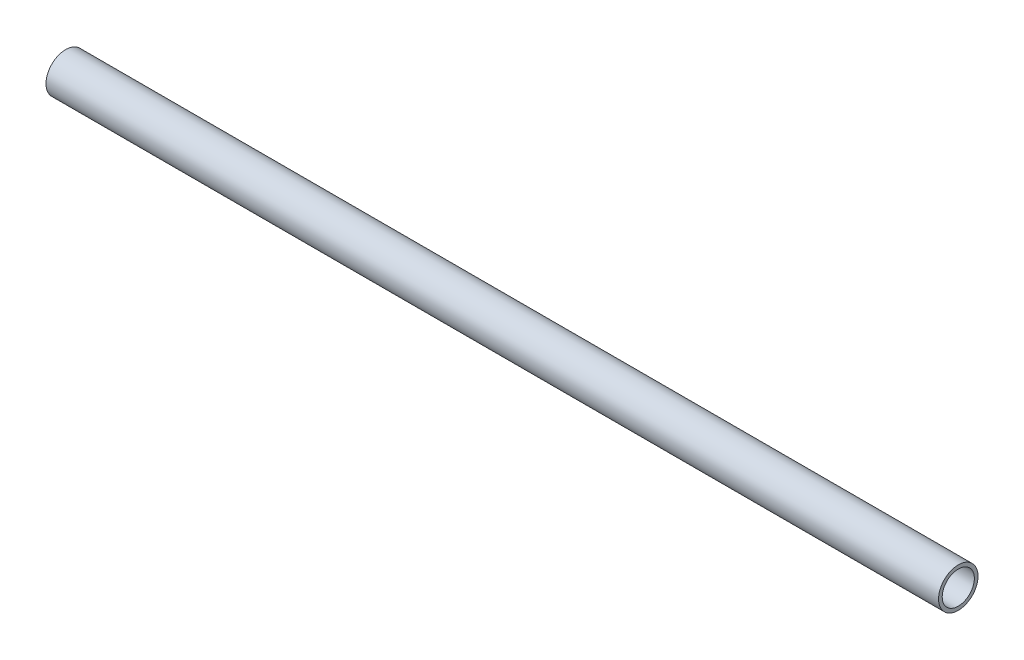
ISO-10303-21;
HEADER;
FILE_DESCRIPTION(('STEP AP214'),'2;1');
FILE_NAME('part.step','',(''),(''),'','','');
FILE_SCHEMA(('AUTOMOTIVE_DESIGN { 1 0 10303 214 1 1 1 1 }'));
ENDSEC;
DATA;
#1=APPLICATION_CONTEXT('core data for automotive mechanical design processes');
#2=APPLICATION_PROTOCOL_DEFINITION('international standard','automotive_design',2000,#1);
#3=PRODUCT_CONTEXT('',#1,'mechanical');
#4=PRODUCT('Part','Part','',(#3));
#5=PRODUCT_RELATED_PRODUCT_CATEGORY('part','',(#4));
#6=PRODUCT_DEFINITION_FORMATION('','',#4);
#7=PRODUCT_DEFINITION_CONTEXT('part definition',#1,'design');
#8=PRODUCT_DEFINITION('design','',#6,#7);
#9=PRODUCT_DEFINITION_SHAPE('','',#8);
#10=(LENGTH_UNIT() NAMED_UNIT(*) SI_UNIT(.MILLI.,.METRE.));
#11=(NAMED_UNIT(*) PLANE_ANGLE_UNIT() SI_UNIT($,.RADIAN.));
#12=(NAMED_UNIT(*) SI_UNIT($,.STERADIAN.) SOLID_ANGLE_UNIT());
#13=UNCERTAINTY_MEASURE_WITH_UNIT(LENGTH_MEASURE(1.E-05),#10,'distance_accuracy_value','');
#14=(GEOMETRIC_REPRESENTATION_CONTEXT(3) GLOBAL_UNCERTAINTY_ASSIGNED_CONTEXT((#13)) GLOBAL_UNIT_ASSIGNED_CONTEXT((#10,
#11,#12)) REPRESENTATION_CONTEXT('',''));
#15=CARTESIAN_POINT('',(0.,0.,0.));
#16=DIRECTION('',(0.,0.,1.));
#17=DIRECTION('',(1.,0.,0.));
#18=AXIS2_PLACEMENT_3D('',#15,#16,#17);
#19=CARTESIAN_POINT('',(358.775,0.,0.));
#20=DIRECTION('',(-1.,0.,0.));
#21=DIRECTION('',(0.,0.,-1.));
#22=AXIS2_PLACEMENT_3D('',#19,#20,#21);
#23=CYLINDRICAL_SURFACE('',#22,6.4643);
#24=CARTESIAN_POINT('',(358.775,0.,0.));
#25=DIRECTION('',(-1.,0.,0.));
#26=DIRECTION('',(0.,0.,1.));
#27=AXIS2_PLACEMENT_3D('',#24,#25,#26);
#28=CIRCLE('',#27,6.4643);
#29=CARTESIAN_POINT('',(358.775,0.,6.4643));
#30=VERTEX_POINT('',#29);
#31=EDGE_CURVE('E37',#30,#30,#28,.T.);
#32=ORIENTED_EDGE('',*,*,#31,.F.);
#33=EDGE_LOOP('',(#32));
#34=FACE_BOUND('',#33,.T.);
#35=CARTESIAN_POINT('',(0.,0.,0.));
#36=DIRECTION('',(-1.,0.,0.));
#37=DIRECTION('',(0.,0.,1.));
#38=AXIS2_PLACEMENT_3D('',#35,#36,#37);
#39=CIRCLE('',#38,6.4643);
#40=CARTESIAN_POINT('',(0.,0.,6.4643));
#41=VERTEX_POINT('',#40);
#42=EDGE_CURVE('E43',#41,#41,#39,.T.);
#43=ORIENTED_EDGE('',*,*,#42,.T.);
#44=EDGE_LOOP('',(#43));
#45=FACE_BOUND('',#44,.T.);
#46=ADVANCED_FACE('F30',(#34,#45),#23,.F.);
#47=CARTESIAN_POINT('',(358.775,0.,0.));
#48=DIRECTION('',(-1.,0.,0.));
#49=DIRECTION('',(0.,0.,-1.));
#50=AXIS2_PLACEMENT_3D('',#47,#48,#49);
#51=CYLINDRICAL_SURFACE('',#50,7.9375);
#52=CARTESIAN_POINT('',(358.775,0.,0.));
#53=DIRECTION('',(-1.,0.,0.));
#54=DIRECTION('',(0.,0.,1.));
#55=AXIS2_PLACEMENT_3D('',#52,#53,#54);
#56=CIRCLE('',#55,7.9375);
#57=CARTESIAN_POINT('',(358.775,0.,7.9375));
#58=VERTEX_POINT('',#57);
#59=EDGE_CURVE('E10',#58,#58,#56,.T.);
#60=ORIENTED_EDGE('',*,*,#59,.T.);
#61=EDGE_LOOP('',(#60));
#62=FACE_BOUND('',#61,.T.);
#63=CARTESIAN_POINT('',(0.,0.,0.));
#64=DIRECTION('',(-1.,0.,0.));
#65=DIRECTION('',(0.,0.,1.));
#66=AXIS2_PLACEMENT_3D('',#63,#64,#65);
#67=CIRCLE('',#66,7.9375);
#68=CARTESIAN_POINT('',(0.,0.,7.9375));
#69=VERTEX_POINT('',#68);
#70=EDGE_CURVE('E33',#69,#69,#67,.T.);
#71=ORIENTED_EDGE('',*,*,#70,.F.);
#72=EDGE_LOOP('',(#71));
#73=FACE_BOUND('',#72,.T.);
#74=ADVANCED_FACE('F52',(#62,#73),#51,.T.);
#75=CARTESIAN_POINT('',(358.775,0.,0.));
#76=DIRECTION('',(1.,0.,0.));
#77=DIRECTION('',(0.,0.,1.));
#78=AXIS2_PLACEMENT_3D('',#75,#76,#77);
#79=PLANE('',#78);
#80=ORIENTED_EDGE('',*,*,#31,.T.);
#81=EDGE_LOOP('',(#80));
#82=FACE_BOUND('',#81,.T.);
#83=ORIENTED_EDGE('',*,*,#59,.F.);
#84=EDGE_LOOP('',(#83));
#85=FACE_BOUND('',#84,.T.);
#86=ADVANCED_FACE('F54',(#82,#85),#79,.T.);
#87=CARTESIAN_POINT('',(0.,0.,0.));
#88=DIRECTION('',(1.,0.,0.));
#89=DIRECTION('',(0.,0.,1.));
#90=AXIS2_PLACEMENT_3D('',#87,#88,#89);
#91=PLANE('',#90);
#92=ORIENTED_EDGE('',*,*,#42,.F.);
#93=EDGE_LOOP('',(#92));
#94=FACE_BOUND('',#93,.T.);
#95=ORIENTED_EDGE('',*,*,#70,.T.);
#96=EDGE_LOOP('',(#95));
#97=FACE_BOUND('',#96,.T.);
#98=ADVANCED_FACE('F50',(#94,#97),#91,.F.);
#99=CLOSED_SHELL('',(#46,#74,#86,#98));
#100=MANIFOLD_SOLID_BREP('B2',#99);
#101=ADVANCED_BREP_SHAPE_REPRESENTATION('',(#18,#100),#14);
#102=SHAPE_DEFINITION_REPRESENTATION(#9,#101);
ENDSEC;
END-ISO-10303-21;
